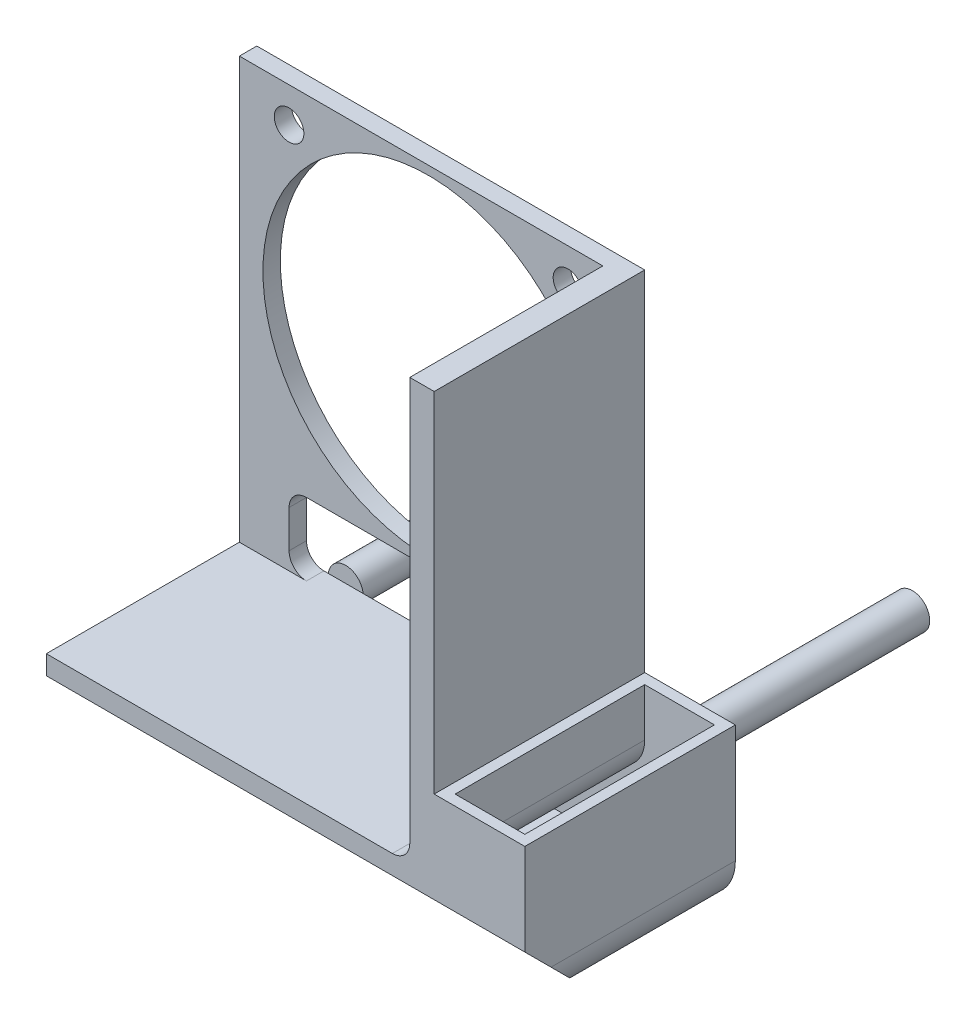
ISO-10303-21;
HEADER;
FILE_DESCRIPTION(('STEP AP214'),'2;1');
FILE_NAME('part.step','',(''),(''),'','','');
FILE_SCHEMA(('AUTOMOTIVE_DESIGN { 1 0 10303 214 1 1 1 1 }'));
ENDSEC;
DATA;
#1=APPLICATION_CONTEXT('core data for automotive mechanical design processes');
#2=APPLICATION_PROTOCOL_DEFINITION('international standard','automotive_design',2000,#1);
#3=PRODUCT_CONTEXT('',#1,'mechanical');
#4=PRODUCT('Part','Part','',(#3));
#5=PRODUCT_RELATED_PRODUCT_CATEGORY('part','',(#4));
#6=PRODUCT_DEFINITION_FORMATION('','',#4);
#7=PRODUCT_DEFINITION_CONTEXT('part definition',#1,'design');
#8=PRODUCT_DEFINITION('design','',#6,#7);
#9=PRODUCT_DEFINITION_SHAPE('','',#8);
#10=(LENGTH_UNIT() NAMED_UNIT(*) SI_UNIT(.MILLI.,.METRE.));
#11=(NAMED_UNIT(*) PLANE_ANGLE_UNIT() SI_UNIT($,.RADIAN.));
#12=(NAMED_UNIT(*) SI_UNIT($,.STERADIAN.) SOLID_ANGLE_UNIT());
#13=UNCERTAINTY_MEASURE_WITH_UNIT(LENGTH_MEASURE(1.E-05),#10,'distance_accuracy_value','');
#14=(GEOMETRIC_REPRESENTATION_CONTEXT(3) GLOBAL_UNCERTAINTY_ASSIGNED_CONTEXT((#13)) GLOBAL_UNIT_ASSIGNED_CONTEXT((#10,
#11,#12)) REPRESENTATION_CONTEXT('',''));
#15=CARTESIAN_POINT('',(0.,0.,0.));
#16=DIRECTION('',(0.,0.,1.));
#17=DIRECTION('',(1.,0.,0.));
#18=AXIS2_PLACEMENT_3D('',#15,#16,#17);
#19=CARTESIAN_POINT('',(2.5,-14.5,-36.));
#20=DIRECTION('',(0.,0.,1.));
#21=DIRECTION('',(1.,0.,0.));
#22=AXIS2_PLACEMENT_3D('',#19,#20,#21);
#23=CYLINDRICAL_SURFACE('',#22,2.);
#24=CARTESIAN_POINT('',(2.5,-14.5,-36.));
#25=DIRECTION('',(0.,0.,-1.));
#26=DIRECTION('',(-1.,0.,0.));
#27=AXIS2_PLACEMENT_3D('',#24,#25,#26);
#28=CIRCLE('',#27,2.);
#29=CARTESIAN_POINT('',(0.499999999999995,-14.5,-36.));
#30=VERTEX_POINT('',#29);
#31=EDGE_CURVE('E11',#30,#30,#28,.T.);
#32=ORIENTED_EDGE('',*,*,#31,.F.);
#33=EDGE_LOOP('',(#32));
#34=FACE_BOUND('',#33,.T.);
#35=CARTESIAN_POINT('',(2.5,-14.5,-6.));
#36=DIRECTION('',(0.,0.,-1.));
#37=DIRECTION('',(-1.,0.,0.));
#38=AXIS2_PLACEMENT_3D('',#35,#36,#37);
#39=CIRCLE('',#38,2.);
#40=CARTESIAN_POINT('',(0.499999999999995,-14.5,-6.));
#41=VERTEX_POINT('',#40);
#42=EDGE_CURVE('E51',#41,#41,#39,.T.);
#43=ORIENTED_EDGE('',*,*,#42,.T.);
#44=EDGE_LOOP('',(#43));
#45=FACE_BOUND('',#44,.T.);
#46=ADVANCED_FACE('F48',(#34,#45),#23,.T.);
#47=CARTESIAN_POINT('',(2.5,-14.5,-36.));
#48=DIRECTION('',(0.,0.,-1.));
#49=DIRECTION('',(-1.,0.,0.));
#50=AXIS2_PLACEMENT_3D('',#47,#48,#49);
#51=PLANE('',#50);
#52=ORIENTED_EDGE('',*,*,#31,.T.);
#53=EDGE_LOOP('',(#52));
#54=FACE_BOUND('',#53,.T.);
#55=ADVANCED_FACE('F63',(#54),#51,.T.);
#56=CARTESIAN_POINT('',(2.5,-14.5,-6.));
#57=DIRECTION('',(0.,0.,-1.));
#58=DIRECTION('',(-1.,0.,0.));
#59=AXIS2_PLACEMENT_3D('',#56,#57,#58);
#60=PLANE('',#59);
#61=ORIENTED_EDGE('',*,*,#42,.F.);
#62=EDGE_LOOP('',(#61));
#63=FACE_BOUND('',#62,.T.);
#64=ADVANCED_FACE('F61',(#63),#60,.F.);
#65=CLOSED_SHELL('',(#46,#55,#64));
#66=MANIFOLD_SOLID_BREP('B2_NOT_SHOWN',#65);
#67=CARTESIAN_POINT('',(37.5,-14.5,-36.));
#68=DIRECTION('',(0.,0.,1.));
#69=DIRECTION('',(1.,0.,0.));
#70=AXIS2_PLACEMENT_3D('',#67,#68,#69);
#71=CYLINDRICAL_SURFACE('',#70,2.);
#72=CARTESIAN_POINT('',(37.5,-14.5,-36.));
#73=DIRECTION('',(0.,0.,-1.));
#74=DIRECTION('',(-1.,0.,0.));
#75=AXIS2_PLACEMENT_3D('',#72,#73,#74);
#76=CIRCLE('',#75,2.);
#77=CARTESIAN_POINT('',(35.5,-14.5,-36.));
#78=VERTEX_POINT('',#77);
#79=EDGE_CURVE('E47',#78,#78,#76,.T.);
#80=ORIENTED_EDGE('',*,*,#79,.F.);
#81=EDGE_LOOP('',(#80));
#82=FACE_BOUND('',#81,.T.);
#83=CARTESIAN_POINT('',(37.5,-14.5,-6.));
#84=DIRECTION('',(0.,0.,-1.));
#85=DIRECTION('',(-1.,0.,0.));
#86=AXIS2_PLACEMENT_3D('',#83,#84,#85);
#87=CIRCLE('',#86,2.);
#88=CARTESIAN_POINT('',(35.5,-14.5,-6.));
#89=VERTEX_POINT('',#88);
#90=EDGE_CURVE('E101',#89,#89,#87,.T.);
#91=ORIENTED_EDGE('',*,*,#90,.T.);
#92=EDGE_LOOP('',(#91));
#93=FACE_BOUND('',#92,.T.);
#94=ADVANCED_FACE('F98',(#82,#93),#71,.T.);
#95=CARTESIAN_POINT('',(37.5,-14.5,-36.));
#96=DIRECTION('',(0.,0.,-1.));
#97=DIRECTION('',(-1.,0.,0.));
#98=AXIS2_PLACEMENT_3D('',#95,#96,#97);
#99=PLANE('',#98);
#100=ORIENTED_EDGE('',*,*,#79,.T.);
#101=EDGE_LOOP('',(#100));
#102=FACE_BOUND('',#101,.T.);
#103=ADVANCED_FACE('F113',(#102),#99,.T.);
#104=CARTESIAN_POINT('',(37.5,-14.5,-6.));
#105=DIRECTION('',(0.,0.,-1.));
#106=DIRECTION('',(-1.,0.,0.));
#107=AXIS2_PLACEMENT_3D('',#104,#105,#106);
#108=PLANE('',#107);
#109=ORIENTED_EDGE('',*,*,#90,.F.);
#110=EDGE_LOOP('',(#109));
#111=FACE_BOUND('',#110,.T.);
#112=ADVANCED_FACE('F111',(#111),#108,.F.);
#113=CLOSED_SHELL('',(#94,#103,#112));
#114=MANIFOLD_SOLID_BREP('B6_NOT_SHOWN',#113);
#115=CARTESIAN_POINT('',(-0.500000000000005,-8.3,1.2));
#116=DIRECTION('',(0.,-1.,0.));
#117=DIRECTION('',(1.,0.,0.));
#118=AXIS2_PLACEMENT_3D('',#115,#116,#117);
#119=PLANE('',#118);
#120=DIRECTION('',(1.,0.,0.));
#121=VECTOR('',#120,1.);
#122=CARTESIAN_POINT('',(0.,-8.3,2.));
#123=LINE('',#122,#121);
#124=CARTESIAN_POINT('',(-1.7,-8.3,2.));
#125=VERTEX_POINT('',#124);
#126=CARTESIAN_POINT('',(6.,-8.3,2.));
#127=VERTEX_POINT('',#126);
#128=EDGE_CURVE('E483',#125,#127,#123,.T.);
#129=ORIENTED_EDGE('',*,*,#128,.F.);
#130=DIRECTION('',(0.,0.,1.));
#131=VECTOR('',#130,1.);
#132=CARTESIAN_POINT('',(-1.7,-8.3,1.2));
#133=LINE('',#132,#131);
#134=CARTESIAN_POINT('',(-1.7,-8.3,24.15));
#135=VERTEX_POINT('',#134);
#136=EDGE_CURVE('E345',#125,#135,#133,.T.);
#137=ORIENTED_EDGE('',*,*,#136,.T.);
#138=DIRECTION('',(1.,0.,0.));
#139=VECTOR('',#138,1.);
#140=CARTESIAN_POINT('',(-0.500000000000005,-8.3,24.15));
#141=LINE('',#140,#139);
#142=CARTESIAN_POINT('',(38.,-8.30000000000001,24.15));
#143=VERTEX_POINT('',#142);
#144=EDGE_CURVE('E462',#135,#143,#141,.T.);
#145=ORIENTED_EDGE('',*,*,#144,.T.);
#146=DIRECTION('',(0.,0.,-1.));
#147=VECTOR('',#146,1.);
#148=CARTESIAN_POINT('',(38.,-8.30000000000001,1.2));
#149=LINE('',#148,#147);
#150=CARTESIAN_POINT('',(38.,-8.30000000000001,0.));
#151=VERTEX_POINT('',#150);
#152=EDGE_CURVE('E544',#143,#151,#149,.T.);
#153=ORIENTED_EDGE('',*,*,#152,.T.);
#154=DIRECTION('',(1.,0.,0.));
#155=VECTOR('',#154,1.);
#156=CARTESIAN_POINT('',(0.,-8.30000000000001,0.));
#157=LINE('',#156,#155);
#158=CARTESIAN_POINT('',(6.,-8.30000000000001,0.));
#159=VERTEX_POINT('',#158);
#160=EDGE_CURVE('E512',#159,#151,#157,.T.);
#161=ORIENTED_EDGE('',*,*,#160,.F.);
#162=DIRECTION('',(0.,0.,1.));
#163=VECTOR('',#162,1.);
#164=CARTESIAN_POINT('',(6.,-8.3,2.));
#165=LINE('',#164,#163);
#166=EDGE_CURVE('E526',#159,#127,#165,.T.);
#167=ORIENTED_EDGE('',*,*,#166,.T.);
#168=EDGE_LOOP('',(#129,#137,#145,#153,#161,#167));
#169=FACE_BOUND('',#168,.T.);
#170=ADVANCED_FACE('F139',(#169),#119,.F.);
#171=CARTESIAN_POINT('',(42.8,-8.30000000000001,72.5310913477569));
#172=DIRECTION('',(1.,0.,0.));
#173=DIRECTION('',(0.,0.,-1.));
#174=AXIS2_PLACEMENT_3D('',#171,#172,#173);
#175=PLANE('',#174);
#176=DIRECTION('',(0.,1.,0.));
#177=VECTOR('',#176,1.);
#178=CARTESIAN_POINT('',(42.8,-8.30000000000001,24.15));
#179=LINE('',#178,#177);
#180=CARTESIAN_POINT('',(42.8,0.,24.15));
#181=VERTEX_POINT('',#180);
#182=CARTESIAN_POINT('',(42.8,40.,24.15));
#183=VERTEX_POINT('',#182);
#184=EDGE_CURVE('E481',#181,#183,#179,.T.);
#185=ORIENTED_EDGE('',*,*,#184,.F.);
#186=DIRECTION('',(0.,0.,1.));
#187=VECTOR('',#186,1.);
#188=CARTESIAN_POINT('',(42.8,0.,1.2));
#189=LINE('',#188,#187);
#190=CARTESIAN_POINT('',(42.8,0.,0.));
#191=VERTEX_POINT('',#190);
#192=EDGE_CURVE('E464',#191,#181,#189,.T.);
#193=ORIENTED_EDGE('',*,*,#192,.F.);
#194=DIRECTION('',(0.,-1.,0.));
#195=VECTOR('',#194,1.);
#196=CARTESIAN_POINT('',(42.8,-8.30000000000001,0.));
#197=LINE('',#196,#195);
#198=CARTESIAN_POINT('',(42.8,40.,0.));
#199=VERTEX_POINT('',#198);
#200=EDGE_CURVE('E448',#199,#191,#197,.T.);
#201=ORIENTED_EDGE('',*,*,#200,.F.);
#202=DIRECTION('',(0.,0.,-1.));
#203=VECTOR('',#202,1.);
#204=CARTESIAN_POINT('',(42.8,40.,72.5310913477569));
#205=LINE('',#204,#203);
#206=EDGE_CURVE('E479',#183,#199,#205,.T.);
#207=ORIENTED_EDGE('',*,*,#206,.F.);
#208=EDGE_LOOP('',(#185,#193,#201,#207));
#209=FACE_BOUND('',#208,.T.);
#210=ADVANCED_FACE('F585',(#209),#175,.T.);
#211=CARTESIAN_POINT('',(0.,40.,2.));
#212=DIRECTION('',(0.,1.,0.));
#213=DIRECTION('',(0.,0.,1.));
#214=AXIS2_PLACEMENT_3D('',#211,#212,#213);
#215=PLANE('',#214);
#216=DIRECTION('',(1.,0.,0.));
#217=VECTOR('',#216,1.);
#218=CARTESIAN_POINT('',(0.,40.,0.));
#219=LINE('',#218,#217);
#220=CARTESIAN_POINT('',(-1.7,40.,0.));
#221=VERTEX_POINT('',#220);
#222=EDGE_CURVE('E336',#221,#199,#219,.T.);
#223=ORIENTED_EDGE('',*,*,#222,.F.);
#224=DIRECTION('',(0.,0.,1.));
#225=VECTOR('',#224,1.);
#226=CARTESIAN_POINT('',(-1.7,40.,-48.3299079245968));
#227=LINE('',#226,#225);
#228=CARTESIAN_POINT('',(-1.7,40.,2.));
#229=VERTEX_POINT('',#228);
#230=EDGE_CURVE('E333',#221,#229,#227,.T.);
#231=ORIENTED_EDGE('',*,*,#230,.T.);
#232=DIRECTION('',(1.,0.,0.));
#233=VECTOR('',#232,1.);
#234=CARTESIAN_POINT('',(0.,40.,2.));
#235=LINE('',#234,#233);
#236=CARTESIAN_POINT('',(40.,40.,2.));
#237=VERTEX_POINT('',#236);
#238=EDGE_CURVE('E317',#229,#237,#235,.T.);
#239=ORIENTED_EDGE('',*,*,#238,.T.);
#240=DIRECTION('',(0.,0.,-1.));
#241=VECTOR('',#240,1.);
#242=CARTESIAN_POINT('',(40.,40.,72.5310913477569));
#243=LINE('',#242,#241);
#244=CARTESIAN_POINT('',(40.,40.,24.15));
#245=VERTEX_POINT('',#244);
#246=EDGE_CURVE('E486',#245,#237,#243,.T.);
#247=ORIENTED_EDGE('',*,*,#246,.F.);
#248=DIRECTION('',(-1.,0.,0.));
#249=VECTOR('',#248,1.);
#250=CARTESIAN_POINT('',(42.8,40.,24.15));
#251=LINE('',#250,#249);
#252=EDGE_CURVE('E478',#183,#245,#251,.T.);
#253=ORIENTED_EDGE('',*,*,#252,.F.);
#254=ORIENTED_EDGE('',*,*,#206,.T.);
#255=EDGE_LOOP('',(#223,#231,#239,#247,#253,#254));
#256=FACE_BOUND('',#255,.T.);
#257=ADVANCED_FACE('F334',(#256),#215,.T.);
#258=CARTESIAN_POINT('',(0.,0.,2.));
#259=DIRECTION('',(0.,0.,1.));
#260=DIRECTION('',(1.,0.,0.));
#261=AXIS2_PLACEMENT_3D('',#258,#259,#260);
#262=PLANE('',#261);
#263=CARTESIAN_POINT('',(20.,20.,2.));
#264=DIRECTION('',(0.,0.,1.));
#265=DIRECTION('',(1.,0.,0.));
#266=AXIS2_PLACEMENT_3D('',#263,#264,#265);
#267=CIRCLE('',#266,19.);
#268=CARTESIAN_POINT('',(39.,20.,2.));
#269=VERTEX_POINT('',#268);
#270=EDGE_CURVE('E340',#269,#269,#267,.T.);
#271=ORIENTED_EDGE('',*,*,#270,.F.);
#272=EDGE_LOOP('',(#271));
#273=FACE_BOUND('',#272,.T.);
#274=DIRECTION('',(0.,-1.,0.));
#275=VECTOR('',#274,1.);
#276=CARTESIAN_POINT('',(4.,-8.30000000000001,2.));
#277=LINE('',#276,#275);
#278=CARTESIAN_POINT('',(4.,-2.,2.));
#279=VERTEX_POINT('',#278);
#280=CARTESIAN_POINT('',(4.,-6.3,2.));
#281=VERTEX_POINT('',#280);
#282=EDGE_CURVE('E354',#279,#281,#277,.T.);
#283=ORIENTED_EDGE('',*,*,#282,.F.);
#284=CARTESIAN_POINT('',(6.,-2.,2.));
#285=DIRECTION('',(0.,0.,1.));
#286=DIRECTION('',(1.,0.,0.));
#287=AXIS2_PLACEMENT_3D('',#284,#285,#286);
#288=CIRCLE('',#287,2.);
#289=CARTESIAN_POINT('',(6.,0.,2.));
#290=VERTEX_POINT('',#289);
#291=EDGE_CURVE('E532',#279,#290,#288,.F.);
#292=ORIENTED_EDGE('',*,*,#291,.T.);
#293=DIRECTION('',(-1.,0.,0.));
#294=VECTOR('',#293,1.);
#295=CARTESIAN_POINT('',(40.,0.,2.));
#296=LINE('',#295,#294);
#297=CARTESIAN_POINT('',(38.,0.,2.));
#298=VERTEX_POINT('',#297);
#299=EDGE_CURVE('E351',#298,#290,#296,.T.);
#300=ORIENTED_EDGE('',*,*,#299,.F.);
#301=CARTESIAN_POINT('',(38.,-2.,2.));
#302=DIRECTION('',(0.,0.,1.));
#303=DIRECTION('',(1.,0.,0.));
#304=AXIS2_PLACEMENT_3D('',#301,#302,#303);
#305=CIRCLE('',#304,2.);
#306=CARTESIAN_POINT('',(40.,-2.,2.));
#307=VERTEX_POINT('',#306);
#308=EDGE_CURVE('E540',#298,#307,#305,.F.);
#309=ORIENTED_EDGE('',*,*,#308,.T.);
#310=DIRECTION('',(0.,1.,0.));
#311=VECTOR('',#310,1.);
#312=CARTESIAN_POINT('',(40.,0.,2.));
#313=LINE('',#312,#311);
#314=EDGE_CURVE('E326',#307,#237,#313,.T.);
#315=ORIENTED_EDGE('',*,*,#314,.T.);
#316=ORIENTED_EDGE('',*,*,#238,.F.);
#317=DIRECTION('',(0.,-1.,0.));
#318=VECTOR('',#317,1.);
#319=CARTESIAN_POINT('',(-1.7,40.,2.));
#320=LINE('',#319,#318);
#321=EDGE_CURVE('E323',#229,#125,#320,.T.);
#322=ORIENTED_EDGE('',*,*,#321,.T.);
#323=ORIENTED_EDGE('',*,*,#128,.T.);
#324=CARTESIAN_POINT('',(6.,-6.3,2.));
#325=DIRECTION('',(0.,0.,1.));
#326=DIRECTION('',(1.,0.,0.));
#327=AXIS2_PLACEMENT_3D('',#324,#325,#326);
#328=CIRCLE('',#327,2.);
#329=EDGE_CURVE('E536',#127,#281,#328,.F.);
#330=ORIENTED_EDGE('',*,*,#329,.T.);
#331=EDGE_LOOP('',(#283,#292,#300,#309,#315,#316,#322,#323,#330));
#332=FACE_BOUND('',#331,.T.);
#333=CARTESIAN_POINT('',(4.00000000000001,36.,2.));
#334=DIRECTION('',(0.,0.,1.));
#335=DIRECTION('',(1.,0.,0.));
#336=AXIS2_PLACEMENT_3D('',#333,#334,#335);
#337=CIRCLE('',#336,1.7);
#338=CARTESIAN_POINT('',(5.70000000000001,36.,2.));
#339=VERTEX_POINT('',#338);
#340=EDGE_CURVE('E490',#339,#339,#337,.T.);
#341=ORIENTED_EDGE('',*,*,#340,.F.);
#342=EDGE_LOOP('',(#341));
#343=FACE_BOUND('',#342,.T.);
#344=CARTESIAN_POINT('',(36.,4.,2.));
#345=DIRECTION('',(0.,0.,1.));
#346=DIRECTION('',(1.,0.,0.));
#347=AXIS2_PLACEMENT_3D('',#344,#345,#346);
#348=CIRCLE('',#347,1.7);
#349=CARTESIAN_POINT('',(37.7,4.,2.));
#350=VERTEX_POINT('',#349);
#351=EDGE_CURVE('E496',#350,#350,#348,.T.);
#352=ORIENTED_EDGE('',*,*,#351,.F.);
#353=EDGE_LOOP('',(#352));
#354=FACE_BOUND('',#353,.T.);
#355=CARTESIAN_POINT('',(36.,36.,2.));
#356=DIRECTION('',(0.,0.,1.));
#357=DIRECTION('',(1.,0.,0.));
#358=AXIS2_PLACEMENT_3D('',#355,#356,#357);
#359=CIRCLE('',#358,1.7);
#360=CARTESIAN_POINT('',(37.7,36.,2.));
#361=VERTEX_POINT('',#360);
#362=EDGE_CURVE('E502',#361,#361,#359,.T.);
#363=ORIENTED_EDGE('',*,*,#362,.F.);
#364=EDGE_LOOP('',(#363));
#365=FACE_BOUND('',#364,.T.);
#366=ADVANCED_FACE('F320',(#273,#332,#343,#354,#365),#262,.T.);
#367=CARTESIAN_POINT('',(0.,0.,0.));
#368=DIRECTION('',(0.,0.,1.));
#369=DIRECTION('',(1.,0.,0.));
#370=AXIS2_PLACEMENT_3D('',#367,#368,#369);
#371=PLANE('',#370);
#372=DIRECTION('',(0.,1.,0.));
#373=VECTOR('',#372,1.);
#374=CARTESIAN_POINT('',(-1.70000000000001,-17.5,0.));
#375=LINE('',#374,#373);
#376=CARTESIAN_POINT('',(-1.70000000000001,-18.7,0.));
#377=VERTEX_POINT('',#376);
#378=EDGE_CURVE('E450',#377,#221,#375,.T.);
#379=ORIENTED_EDGE('',*,*,#378,.T.);
#380=ORIENTED_EDGE('',*,*,#222,.T.);
#381=ORIENTED_EDGE('',*,*,#200,.T.);
#382=DIRECTION('',(1.,0.,0.));
#383=VECTOR('',#382,1.);
#384=CARTESIAN_POINT('',(44.,0.,0.));
#385=LINE('',#384,#383);
#386=CARTESIAN_POINT('',(53.2,0.,0.));
#387=VERTEX_POINT('',#386);
#388=EDGE_CURVE('E452',#191,#387,#385,.T.);
#389=ORIENTED_EDGE('',*,*,#388,.T.);
#390=DIRECTION('',(0.,-1.,0.));
#391=VECTOR('',#390,1.);
#392=CARTESIAN_POINT('',(53.2,0.,0.));
#393=LINE('',#392,#391);
#394=CARTESIAN_POINT('',(53.2,-13.5,0.));
#395=VERTEX_POINT('',#394);
#396=EDGE_CURVE('E439',#387,#395,#393,.T.);
#397=ORIENTED_EDGE('',*,*,#396,.T.);
#398=CARTESIAN_POINT('',(48.,-13.5,0.));
#399=DIRECTION('',(0.,0.,-1.));
#400=DIRECTION('',(-1.,0.,0.));
#401=AXIS2_PLACEMENT_3D('',#398,#399,#400);
#402=CIRCLE('',#401,5.2);
#403=CARTESIAN_POINT('',(48.,-18.7,0.));
#404=VERTEX_POINT('',#403);
#405=EDGE_CURVE('E437',#395,#404,#402,.T.);
#406=ORIENTED_EDGE('',*,*,#405,.T.);
#407=DIRECTION('',(-1.,0.,0.));
#408=VECTOR('',#407,1.);
#409=CARTESIAN_POINT('',(52.,-18.7,0.));
#410=LINE('',#409,#408);
#411=EDGE_CURVE('E442',#404,#377,#410,.T.);
#412=ORIENTED_EDGE('',*,*,#411,.T.);
#413=EDGE_LOOP('',(#379,#380,#381,#389,#397,#406,#412));
#414=FACE_BOUND('',#413,.T.);
#415=CARTESIAN_POINT('',(20.,20.,0.));
#416=DIRECTION('',(0.,0.,1.));
#417=DIRECTION('',(1.,0.,0.));
#418=AXIS2_PLACEMENT_3D('',#415,#416,#417);
#419=CIRCLE('',#418,19.);
#420=CARTESIAN_POINT('',(39.,20.,0.));
#421=VERTEX_POINT('',#420);
#422=EDGE_CURVE('E350',#421,#421,#419,.T.);
#423=ORIENTED_EDGE('',*,*,#422,.T.);
#424=EDGE_LOOP('',(#423));
#425=FACE_BOUND('',#424,.T.);
#426=DIRECTION('',(0.,-1.,0.));
#427=VECTOR('',#426,1.);
#428=CARTESIAN_POINT('',(4.,0.,0.));
#429=LINE('',#428,#427);
#430=CARTESIAN_POINT('',(4.,-2.,0.));
#431=VERTEX_POINT('',#430);
#432=CARTESIAN_POINT('',(4.,-6.3,0.));
#433=VERTEX_POINT('',#432);
#434=EDGE_CURVE('E357',#431,#433,#429,.T.);
#435=ORIENTED_EDGE('',*,*,#434,.T.);
#436=CARTESIAN_POINT('',(6.,-6.3,0.));
#437=DIRECTION('',(0.,0.,1.));
#438=DIRECTION('',(1.,0.,0.));
#439=AXIS2_PLACEMENT_3D('',#436,#437,#438);
#440=CIRCLE('',#439,2.);
#441=EDGE_CURVE('E538',#433,#159,#440,.T.);
#442=ORIENTED_EDGE('',*,*,#441,.T.);
#443=ORIENTED_EDGE('',*,*,#160,.T.);
#444=CARTESIAN_POINT('',(38.,-6.30000000000001,0.));
#445=DIRECTION('',(0.,0.,1.));
#446=DIRECTION('',(1.,0.,0.));
#447=AXIS2_PLACEMENT_3D('',#444,#445,#446);
#448=CIRCLE('',#447,2.);
#449=CARTESIAN_POINT('',(40.,-6.30000000000001,0.));
#450=VERTEX_POINT('',#449);
#451=EDGE_CURVE('E147',#151,#450,#448,.T.);
#452=ORIENTED_EDGE('',*,*,#451,.T.);
#453=DIRECTION('',(0.,1.,0.));
#454=VECTOR('',#453,1.);
#455=CARTESIAN_POINT('',(40.,0.,0.));
#456=LINE('',#455,#454);
#457=CARTESIAN_POINT('',(40.,-2.,0.));
#458=VERTEX_POINT('',#457);
#459=EDGE_CURVE('E360',#450,#458,#456,.T.);
#460=ORIENTED_EDGE('',*,*,#459,.T.);
#461=CARTESIAN_POINT('',(38.,-2.,0.));
#462=DIRECTION('',(0.,0.,1.));
#463=DIRECTION('',(1.,0.,0.));
#464=AXIS2_PLACEMENT_3D('',#461,#462,#463);
#465=CIRCLE('',#464,2.);
#466=CARTESIAN_POINT('',(38.,0.,0.));
#467=VERTEX_POINT('',#466);
#468=EDGE_CURVE('E542',#458,#467,#465,.T.);
#469=ORIENTED_EDGE('',*,*,#468,.T.);
#470=DIRECTION('',(-1.,0.,0.));
#471=VECTOR('',#470,1.);
#472=CARTESIAN_POINT('',(0.,0.,0.));
#473=LINE('',#472,#471);
#474=CARTESIAN_POINT('',(6.,0.,0.));
#475=VERTEX_POINT('',#474);
#476=EDGE_CURVE('E330',#467,#475,#473,.T.);
#477=ORIENTED_EDGE('',*,*,#476,.T.);
#478=CARTESIAN_POINT('',(6.,-2.,0.));
#479=DIRECTION('',(0.,0.,1.));
#480=DIRECTION('',(1.,0.,0.));
#481=AXIS2_PLACEMENT_3D('',#478,#479,#480);
#482=CIRCLE('',#481,2.);
#483=EDGE_CURVE('E534',#475,#431,#482,.T.);
#484=ORIENTED_EDGE('',*,*,#483,.T.);
#485=EDGE_LOOP('',(#435,#442,#443,#452,#460,#469,#477,#484));
#486=FACE_BOUND('',#485,.T.);
#487=CARTESIAN_POINT('',(36.,36.,0.));
#488=DIRECTION('',(0.,0.,1.));
#489=DIRECTION('',(1.,0.,0.));
#490=AXIS2_PLACEMENT_3D('',#487,#488,#489);
#491=CIRCLE('',#490,1.7);
#492=CARTESIAN_POINT('',(37.7,36.,0.));
#493=VERTEX_POINT('',#492);
#494=EDGE_CURVE('E505',#493,#493,#491,.T.);
#495=ORIENTED_EDGE('',*,*,#494,.T.);
#496=EDGE_LOOP('',(#495));
#497=FACE_BOUND('',#496,.T.);
#498=CARTESIAN_POINT('',(36.,4.,0.));
#499=DIRECTION('',(0.,0.,1.));
#500=DIRECTION('',(1.,0.,0.));
#501=AXIS2_PLACEMENT_3D('',#498,#499,#500);
#502=CIRCLE('',#501,1.7);
#503=CARTESIAN_POINT('',(37.7,4.,0.));
#504=VERTEX_POINT('',#503);
#505=EDGE_CURVE('E499',#504,#504,#502,.T.);
#506=ORIENTED_EDGE('',*,*,#505,.T.);
#507=EDGE_LOOP('',(#506));
#508=FACE_BOUND('',#507,.T.);
#509=CARTESIAN_POINT('',(4.00000000000001,36.,0.));
#510=DIRECTION('',(0.,0.,1.));
#511=DIRECTION('',(1.,0.,0.));
#512=AXIS2_PLACEMENT_3D('',#509,#510,#511);
#513=CIRCLE('',#512,1.7);
#514=CARTESIAN_POINT('',(5.70000000000001,36.,0.));
#515=VERTEX_POINT('',#514);
#516=EDGE_CURVE('E493',#515,#515,#513,.T.);
#517=ORIENTED_EDGE('',*,*,#516,.T.);
#518=EDGE_LOOP('',(#517));
#519=FACE_BOUND('',#518,.T.);
#520=ADVANCED_FACE('F554',(#414,#425,#486,#497,#508,#519),#371,.F.);
#521=CARTESIAN_POINT('',(36.,36.,2.));
#522=DIRECTION('',(0.,0.,1.));
#523=DIRECTION('',(1.,0.,0.));
#524=AXIS2_PLACEMENT_3D('',#521,#522,#523);
#525=CYLINDRICAL_SURFACE('',#524,1.7);
#526=ORIENTED_EDGE('',*,*,#494,.F.);
#527=EDGE_LOOP('',(#526));
#528=FACE_BOUND('',#527,.T.);
#529=ORIENTED_EDGE('',*,*,#362,.T.);
#530=EDGE_LOOP('',(#529));
#531=FACE_BOUND('',#530,.T.);
#532=ADVANCED_FACE('F690',(#528,#531),#525,.F.);
#533=CARTESIAN_POINT('',(36.,4.,2.));
#534=DIRECTION('',(0.,0.,1.));
#535=DIRECTION('',(1.,0.,0.));
#536=AXIS2_PLACEMENT_3D('',#533,#534,#535);
#537=CYLINDRICAL_SURFACE('',#536,1.7);
#538=ORIENTED_EDGE('',*,*,#505,.F.);
#539=EDGE_LOOP('',(#538));
#540=FACE_BOUND('',#539,.T.);
#541=ORIENTED_EDGE('',*,*,#351,.T.);
#542=EDGE_LOOP('',(#541));
#543=FACE_BOUND('',#542,.T.);
#544=ADVANCED_FACE('F686',(#540,#543),#537,.F.);
#545=CARTESIAN_POINT('',(4.00000000000001,36.,2.));
#546=DIRECTION('',(0.,0.,1.));
#547=DIRECTION('',(1.,0.,0.));
#548=AXIS2_PLACEMENT_3D('',#545,#546,#547);
#549=CYLINDRICAL_SURFACE('',#548,1.7);
#550=ORIENTED_EDGE('',*,*,#516,.F.);
#551=EDGE_LOOP('',(#550));
#552=FACE_BOUND('',#551,.T.);
#553=ORIENTED_EDGE('',*,*,#340,.T.);
#554=EDGE_LOOP('',(#553));
#555=FACE_BOUND('',#554,.T.);
#556=ADVANCED_FACE('F682',(#552,#555),#549,.F.);
#557=CARTESIAN_POINT('',(40.,-8.30000000000001,72.5310913477569));
#558=DIRECTION('',(-1.,0.,0.));
#559=DIRECTION('',(0.,0.,1.));
#560=AXIS2_PLACEMENT_3D('',#557,#558,#559);
#561=PLANE('',#560);
#562=ORIENTED_EDGE('',*,*,#459,.F.);
#563=DIRECTION('',(0.,0.,-1.));
#564=VECTOR('',#563,1.);
#565=CARTESIAN_POINT('',(40.,-6.30000000000001,72.5310913477569));
#566=LINE('',#565,#564);
#567=CARTESIAN_POINT('',(40.,-6.30000000000001,24.15));
#568=VERTEX_POINT('',#567);
#569=EDGE_CURVE('E154',#450,#568,#566,.F.);
#570=ORIENTED_EDGE('',*,*,#569,.T.);
#571=DIRECTION('',(0.,-1.,0.));
#572=VECTOR('',#571,1.);
#573=CARTESIAN_POINT('',(40.,-8.30000000000001,24.15));
#574=LINE('',#573,#572);
#575=EDGE_CURVE('E476',#245,#568,#574,.T.);
#576=ORIENTED_EDGE('',*,*,#575,.F.);
#577=ORIENTED_EDGE('',*,*,#246,.T.);
#578=ORIENTED_EDGE('',*,*,#314,.F.);
#579=DIRECTION('',(0.,0.,1.));
#580=VECTOR('',#579,1.);
#581=CARTESIAN_POINT('',(40.,-2.,72.5310913477569));
#582=LINE('',#581,#580);
#583=EDGE_CURVE('E529',#307,#458,#582,.F.);
#584=ORIENTED_EDGE('',*,*,#583,.T.);
#585=EDGE_LOOP('',(#562,#570,#576,#577,#578,#584));
#586=FACE_BOUND('',#585,.T.);
#587=ADVANCED_FACE('F578',(#586),#561,.T.);
#588=CARTESIAN_POINT('',(0.,0.,24.15));
#589=DIRECTION('',(0.,0.,-1.));
#590=DIRECTION('',(-1.,0.,0.));
#591=AXIS2_PLACEMENT_3D('',#588,#589,#590);
#592=PLANE('',#591);
#593=ORIENTED_EDGE('',*,*,#575,.T.);
#594=CARTESIAN_POINT('',(38.,-6.30000000000001,24.15));
#595=DIRECTION('',(0.,0.,-1.));
#596=DIRECTION('',(-1.,0.,0.));
#597=AXIS2_PLACEMENT_3D('',#594,#595,#596);
#598=CIRCLE('',#597,2.);
#599=EDGE_CURVE('E96',#568,#143,#598,.T.);
#600=ORIENTED_EDGE('',*,*,#599,.T.);
#601=ORIENTED_EDGE('',*,*,#144,.F.);
#602=DIRECTION('',(0.,1.,0.));
#603=VECTOR('',#602,1.);
#604=CARTESIAN_POINT('',(-1.70000000000001,-17.5,24.15));
#605=LINE('',#604,#603);
#606=CARTESIAN_POINT('',(-1.70000000000001,-10.4970562748477,24.15));
#607=VERTEX_POINT('',#606);
#608=EDGE_CURVE('E446',#607,#135,#605,.T.);
#609=ORIENTED_EDGE('',*,*,#608,.F.);
#610=DIRECTION('',(-1.,0.,0.));
#611=VECTOR('',#610,1.);
#612=CARTESIAN_POINT('',(52.,-10.4970562748477,24.15));
#613=LINE('',#612,#611);
#614=CARTESIAN_POINT('',(53.2,-10.4970562748477,24.15));
#615=VERTEX_POINT('',#614);
#616=EDGE_CURVE('E434',#607,#615,#613,.F.);
#617=ORIENTED_EDGE('',*,*,#616,.T.);
#618=DIRECTION('',(0.,-1.,0.));
#619=VECTOR('',#618,1.);
#620=CARTESIAN_POINT('',(53.2,0.,24.15));
#621=LINE('',#620,#619);
#622=CARTESIAN_POINT('',(53.2,0.,24.15));
#623=VERTEX_POINT('',#622);
#624=EDGE_CURVE('E429',#623,#615,#621,.T.);
#625=ORIENTED_EDGE('',*,*,#624,.F.);
#626=DIRECTION('',(1.,0.,0.));
#627=VECTOR('',#626,1.);
#628=CARTESIAN_POINT('',(44.,0.,24.15));
#629=LINE('',#628,#627);
#630=EDGE_CURVE('E443',#181,#623,#629,.T.);
#631=ORIENTED_EDGE('',*,*,#630,.F.);
#632=ORIENTED_EDGE('',*,*,#184,.T.);
#633=ORIENTED_EDGE('',*,*,#252,.T.);
#634=EDGE_LOOP('',(#593,#600,#601,#609,#617,#625,#631,#632,#633));
#635=FACE_BOUND('',#634,.T.);
#636=ADVANCED_FACE('F603',(#635),#592,.F.);
#637=CARTESIAN_POINT('',(44.,0.,1.2));
#638=DIRECTION('',(0.,-1.,0.));
#639=DIRECTION('',(0.,0.,-1.));
#640=AXIS2_PLACEMENT_3D('',#637,#638,#639);
#641=PLANE('',#640);
#642=ORIENTED_EDGE('',*,*,#630,.T.);
#643=DIRECTION('',(0.,0.,1.));
#644=VECTOR('',#643,1.);
#645=CARTESIAN_POINT('',(53.2,0.,1.2));
#646=LINE('',#645,#644);
#647=EDGE_CURVE('E469',#387,#623,#646,.T.);
#648=ORIENTED_EDGE('',*,*,#647,.F.);
#649=ORIENTED_EDGE('',*,*,#388,.F.);
#650=ORIENTED_EDGE('',*,*,#192,.T.);
#651=EDGE_LOOP('',(#642,#648,#649,#650));
#652=FACE_BOUND('',#651,.T.);
#653=DIRECTION('',(1.,0.,0.));
#654=VECTOR('',#653,1.);
#655=CARTESIAN_POINT('',(44.,0.,22.95));
#656=LINE('',#655,#654);
#657=CARTESIAN_POINT('',(44.,0.,22.95));
#658=VERTEX_POINT('',#657);
#659=CARTESIAN_POINT('',(52.,0.,22.95));
#660=VERTEX_POINT('',#659);
#661=EDGE_CURVE('E367',#658,#660,#656,.T.);
#662=ORIENTED_EDGE('',*,*,#661,.F.);
#663=DIRECTION('',(0.,0.,1.));
#664=VECTOR('',#663,1.);
#665=CARTESIAN_POINT('',(44.,0.,1.2));
#666=LINE('',#665,#664);
#667=CARTESIAN_POINT('',(44.,0.,1.2));
#668=VERTEX_POINT('',#667);
#669=EDGE_CURVE('E393',#668,#658,#666,.T.);
#670=ORIENTED_EDGE('',*,*,#669,.F.);
#671=DIRECTION('',(1.,0.,0.));
#672=VECTOR('',#671,1.);
#673=CARTESIAN_POINT('',(44.,0.,1.2));
#674=LINE('',#673,#672);
#675=CARTESIAN_POINT('',(52.,0.,1.2));
#676=VERTEX_POINT('',#675);
#677=EDGE_CURVE('E377',#668,#676,#674,.T.);
#678=ORIENTED_EDGE('',*,*,#677,.T.);
#679=DIRECTION('',(0.,0.,1.));
#680=VECTOR('',#679,1.);
#681=CARTESIAN_POINT('',(52.,0.,1.2));
#682=LINE('',#681,#680);
#683=EDGE_CURVE('E380',#676,#660,#682,.T.);
#684=ORIENTED_EDGE('',*,*,#683,.T.);
#685=EDGE_LOOP('',(#662,#670,#678,#684));
#686=FACE_BOUND('',#685,.T.);
#687=ADVANCED_FACE('F609',(#652,#686),#641,.F.);
#688=CARTESIAN_POINT('',(53.2,0.,1.2));
#689=DIRECTION('',(-1.,0.,0.));
#690=DIRECTION('',(0.,0.,1.));
#691=AXIS2_PLACEMENT_3D('',#688,#689,#690);
#692=PLANE('',#691);
#693=DIRECTION('',(0.,0.707106781186549,0.707106781186546));
#694=VECTOR('',#693,1.);
#695=CARTESIAN_POINT('',(53.2,-18.3485281374239,16.2985281374239));
#696=LINE('',#695,#694);
#697=CARTESIAN_POINT('',(53.2,-13.5,21.1470562748477));
#698=VERTEX_POINT('',#697);
#699=EDGE_CURVE('E430',#615,#698,#696,.F.);
#700=ORIENTED_EDGE('',*,*,#699,.T.);
#701=DIRECTION('',(0.,0.,1.));
#702=VECTOR('',#701,1.);
#703=CARTESIAN_POINT('',(53.2,-13.5,1.2));
#704=LINE('',#703,#702);
#705=EDGE_CURVE('E435',#698,#395,#704,.F.);
#706=ORIENTED_EDGE('',*,*,#705,.T.);
#707=ORIENTED_EDGE('',*,*,#396,.F.);
#708=ORIENTED_EDGE('',*,*,#647,.T.);
#709=ORIENTED_EDGE('',*,*,#624,.T.);
#710=EDGE_LOOP('',(#700,#706,#707,#708,#709));
#711=FACE_BOUND('',#710,.T.);
#712=ADVANCED_FACE('F605',(#711),#692,.F.);
#713=CARTESIAN_POINT('',(52.,-18.7,1.2));
#714=DIRECTION('',(0.,1.,0.));
#715=DIRECTION('',(0.,0.,1.));
#716=AXIS2_PLACEMENT_3D('',#713,#714,#715);
#717=PLANE('',#716);
#718=ORIENTED_EDGE('',*,*,#411,.F.);
#719=DIRECTION('',(0.,0.,1.));
#720=VECTOR('',#719,1.);
#721=CARTESIAN_POINT('',(48.,-18.7,1.2));
#722=LINE('',#721,#720);
#723=CARTESIAN_POINT('',(48.,-18.7,15.9470562748477));
#724=VERTEX_POINT('',#723);
#725=EDGE_CURVE('E433',#404,#724,#722,.T.);
#726=ORIENTED_EDGE('',*,*,#725,.T.);
#727=DIRECTION('',(1.,0.,0.));
#728=VECTOR('',#727,1.);
#729=CARTESIAN_POINT('',(52.,-18.7,15.9470562748477));
#730=LINE('',#729,#728);
#731=CARTESIAN_POINT('',(-1.70000000000001,-18.7,15.9470562748477));
#732=VERTEX_POINT('',#731);
#733=EDGE_CURVE('E455',#724,#732,#730,.F.);
#734=ORIENTED_EDGE('',*,*,#733,.T.);
#735=DIRECTION('',(0.,0.,1.));
#736=VECTOR('',#735,1.);
#737=CARTESIAN_POINT('',(-1.70000000000001,-18.7,1.2));
#738=LINE('',#737,#736);
#739=EDGE_CURVE('E458',#377,#732,#738,.T.);
#740=ORIENTED_EDGE('',*,*,#739,.F.);
#741=EDGE_LOOP('',(#718,#726,#734,#740));
#742=FACE_BOUND('',#741,.T.);
#743=ADVANCED_FACE('F595',(#742),#717,.F.);
#744=CARTESIAN_POINT('',(-1.70000000000001,-17.5,1.2));
#745=DIRECTION('',(1.,0.,0.));
#746=DIRECTION('',(0.,1.,0.));
#747=AXIS2_PLACEMENT_3D('',#744,#745,#746);
#748=PLANE('',#747);
#749=ORIENTED_EDGE('',*,*,#739,.T.);
#750=DIRECTION('',(0.,-0.707106781186549,-0.707106781186546));
#751=VECTOR('',#750,1.);
#752=CARTESIAN_POINT('',(-1.70000000000001,-18.3485281374238,16.2985281374239));
#753=LINE('',#752,#751);
#754=EDGE_CURVE('E457',#732,#607,#753,.F.);
#755=ORIENTED_EDGE('',*,*,#754,.T.);
#756=ORIENTED_EDGE('',*,*,#608,.T.);
#757=ORIENTED_EDGE('',*,*,#136,.F.);
#758=ORIENTED_EDGE('',*,*,#321,.F.);
#759=ORIENTED_EDGE('',*,*,#230,.F.);
#760=ORIENTED_EDGE('',*,*,#378,.F.);
#761=EDGE_LOOP('',(#749,#755,#756,#757,#758,#759,#760));
#762=FACE_BOUND('',#761,.T.);
#763=ADVANCED_FACE('F343',(#762),#748,.F.);
#764=CARTESIAN_POINT('',(52.,-18.3485281374239,16.2985281374239));
#765=DIRECTION('',(0.,0.707106781186546,-0.707106781186549));
#766=DIRECTION('',(-1.,0.,0.));
#767=AXIS2_PLACEMENT_3D('',#764,#765,#766);
#768=PLANE('',#767);
#769=ORIENTED_EDGE('',*,*,#733,.F.);
#770=CARTESIAN_POINT('',(48.,-13.5,21.1470562748477));
#771=DIRECTION('',(0.,0.707106781186546,-0.707106781186549));
#772=DIRECTION('',(0.,0.707106781186549,0.707106781186546));
#773=AXIS2_PLACEMENT_3D('',#770,#771,#772);
#774=ELLIPSE('',#773,7.35391052434008,5.2);
#775=EDGE_CURVE('E438',#724,#698,#774,.F.);
#776=ORIENTED_EDGE('',*,*,#775,.T.);
#777=ORIENTED_EDGE('',*,*,#699,.F.);
#778=ORIENTED_EDGE('',*,*,#616,.F.);
#779=ORIENTED_EDGE('',*,*,#754,.F.);
#780=EDGE_LOOP('',(#769,#776,#777,#778,#779));
#781=FACE_BOUND('',#780,.T.);
#782=ADVANCED_FACE('F600',(#781),#768,.F.);
#783=CARTESIAN_POINT('',(48.,-13.5,1.2));
#784=DIRECTION('',(0.,0.,1.));
#785=DIRECTION('',(1.,0.,0.));
#786=AXIS2_PLACEMENT_3D('',#783,#784,#785);
#787=CYLINDRICAL_SURFACE('',#786,5.2);
#788=ORIENTED_EDGE('',*,*,#405,.F.);
#789=ORIENTED_EDGE('',*,*,#705,.F.);
#790=ORIENTED_EDGE('',*,*,#775,.F.);
#791=ORIENTED_EDGE('',*,*,#725,.F.);
#792=EDGE_LOOP('',(#788,#789,#790,#791));
#793=FACE_BOUND('',#792,.T.);
#794=ADVANCED_FACE('F663',(#793),#787,.T.);
#795=CARTESIAN_POINT('',(52.,0.,1.2));
#796=DIRECTION('',(-1.,0.,0.));
#797=DIRECTION('',(0.,0.,1.));
#798=AXIS2_PLACEMENT_3D('',#795,#796,#797);
#799=PLANE('',#798);
#800=DIRECTION('',(0.,0.707106781186549,0.707106781186546));
#801=VECTOR('',#800,1.);
#802=CARTESIAN_POINT('',(52.,-17.5,15.45));
#803=LINE('',#802,#801);
#804=CARTESIAN_POINT('',(52.,-9.99999999999998,22.95));
#805=VERTEX_POINT('',#804);
#806=CARTESIAN_POINT('',(52.,-13.5,19.45));
#807=VERTEX_POINT('',#806);
#808=EDGE_CURVE('E408',#805,#807,#803,.F.);
#809=ORIENTED_EDGE('',*,*,#808,.F.);
#810=DIRECTION('',(0.,-1.,0.));
#811=VECTOR('',#810,1.);
#812=CARTESIAN_POINT('',(52.,0.,22.95));
#813=LINE('',#812,#811);
#814=EDGE_CURVE('E362',#660,#805,#813,.T.);
#815=ORIENTED_EDGE('',*,*,#814,.F.);
#816=ORIENTED_EDGE('',*,*,#683,.F.);
#817=DIRECTION('',(0.,-1.,0.));
#818=VECTOR('',#817,1.);
#819=CARTESIAN_POINT('',(52.,0.,1.2));
#820=LINE('',#819,#818);
#821=CARTESIAN_POINT('',(52.,-13.5,1.2));
#822=VERTEX_POINT('',#821);
#823=EDGE_CURVE('E363',#676,#822,#820,.T.);
#824=ORIENTED_EDGE('',*,*,#823,.T.);
#825=DIRECTION('',(0.,0.,1.));
#826=VECTOR('',#825,1.);
#827=CARTESIAN_POINT('',(52.,-13.5,1.2));
#828=LINE('',#827,#826);
#829=EDGE_CURVE('E416',#807,#822,#828,.F.);
#830=ORIENTED_EDGE('',*,*,#829,.F.);
#831=EDGE_LOOP('',(#809,#815,#816,#824,#830));
#832=FACE_BOUND('',#831,.T.);
#833=ADVANCED_FACE('F622',(#832),#799,.T.);
#834=CARTESIAN_POINT('',(52.,-17.5,1.2));
#835=DIRECTION('',(0.,1.,0.));
#836=DIRECTION('',(0.,0.,1.));
#837=AXIS2_PLACEMENT_3D('',#834,#835,#836);
#838=PLANE('',#837);
#839=DIRECTION('',(-1.,0.,0.));
#840=VECTOR('',#839,1.);
#841=CARTESIAN_POINT('',(52.,-17.5,1.2));
#842=LINE('',#841,#840);
#843=CARTESIAN_POINT('',(48.,-17.5,1.2));
#844=VERTEX_POINT('',#843);
#845=CARTESIAN_POINT('',(-0.500000000000007,-17.5,1.2));
#846=VERTEX_POINT('',#845);
#847=EDGE_CURVE('E366',#844,#846,#842,.T.);
#848=ORIENTED_EDGE('',*,*,#847,.T.);
#849=DIRECTION('',(0.,0.,1.));
#850=VECTOR('',#849,1.);
#851=CARTESIAN_POINT('',(-0.500000000000007,-17.5,1.2));
#852=LINE('',#851,#850);
#853=CARTESIAN_POINT('',(-0.500000000000007,-17.5,15.45));
#854=VERTEX_POINT('',#853);
#855=EDGE_CURVE('E399',#846,#854,#852,.T.);
#856=ORIENTED_EDGE('',*,*,#855,.T.);
#857=DIRECTION('',(-1.,0.,0.));
#858=VECTOR('',#857,1.);
#859=CARTESIAN_POINT('',(52.,-17.5,15.45));
#860=LINE('',#859,#858);
#861=CARTESIAN_POINT('',(48.,-17.5,15.45));
#862=VERTEX_POINT('',#861);
#863=EDGE_CURVE('E402',#862,#854,#860,.T.);
#864=ORIENTED_EDGE('',*,*,#863,.F.);
#865=DIRECTION('',(0.,0.,1.));
#866=VECTOR('',#865,1.);
#867=CARTESIAN_POINT('',(48.,-17.5,1.2));
#868=LINE('',#867,#866);
#869=EDGE_CURVE('E411',#844,#862,#868,.T.);
#870=ORIENTED_EDGE('',*,*,#869,.F.);
#871=EDGE_LOOP('',(#848,#856,#864,#870));
#872=FACE_BOUND('',#871,.T.);
#873=ADVANCED_FACE('F655',(#872),#838,.T.);
#874=CARTESIAN_POINT('',(-0.500000000000007,-17.5,1.2));
#875=DIRECTION('',(1.,0.,0.));
#876=DIRECTION('',(0.,1.,0.));
#877=AXIS2_PLACEMENT_3D('',#874,#875,#876);
#878=PLANE('',#877);
#879=ORIENTED_EDGE('',*,*,#855,.F.);
#880=DIRECTION('',(0.,1.,0.));
#881=VECTOR('',#880,1.);
#882=CARTESIAN_POINT('',(-0.500000000000007,-17.5,1.2));
#883=LINE('',#882,#881);
#884=CARTESIAN_POINT('',(-0.500000000000005,-9.5,1.2));
#885=VERTEX_POINT('',#884);
#886=EDGE_CURVE('E369',#846,#885,#883,.T.);
#887=ORIENTED_EDGE('',*,*,#886,.T.);
#888=DIRECTION('',(0.,0.,1.));
#889=VECTOR('',#888,1.);
#890=CARTESIAN_POINT('',(-0.500000000000005,-9.5,1.2));
#891=LINE('',#890,#889);
#892=CARTESIAN_POINT('',(-0.500000000000005,-9.5,22.95));
#893=VERTEX_POINT('',#892);
#894=EDGE_CURVE('E396',#885,#893,#891,.T.);
#895=ORIENTED_EDGE('',*,*,#894,.T.);
#896=DIRECTION('',(0.,1.,0.));
#897=VECTOR('',#896,1.);
#898=CARTESIAN_POINT('',(-0.500000000000007,-17.5,22.95));
#899=LINE('',#898,#897);
#900=CARTESIAN_POINT('',(-0.500000000000005,-9.99999999999998,22.95));
#901=VERTEX_POINT('',#900);
#902=EDGE_CURVE('E383',#901,#893,#899,.T.);
#903=ORIENTED_EDGE('',*,*,#902,.F.);
#904=DIRECTION('',(0.,-0.707106781186549,-0.707106781186546));
#905=VECTOR('',#904,1.);
#906=CARTESIAN_POINT('',(-0.500000000000007,-17.5,15.45));
#907=LINE('',#906,#905);
#908=EDGE_CURVE('E404',#854,#901,#907,.F.);
#909=ORIENTED_EDGE('',*,*,#908,.F.);
#910=EDGE_LOOP('',(#879,#887,#895,#903,#909));
#911=FACE_BOUND('',#910,.T.);
#912=ADVANCED_FACE('F634',(#911),#878,.T.);
#913=CARTESIAN_POINT('',(-0.500000000000005,-9.5,1.2));
#914=DIRECTION('',(0.,-1.,0.));
#915=DIRECTION('',(1.,0.,0.));
#916=AXIS2_PLACEMENT_3D('',#913,#914,#915);
#917=PLANE('',#916);
#918=DIRECTION('',(1.,0.,0.));
#919=VECTOR('',#918,1.);
#920=CARTESIAN_POINT('',(-0.500000000000005,-9.5,22.95));
#921=LINE('',#920,#919);
#922=CARTESIAN_POINT('',(40.,-9.50000000000001,22.95));
#923=VERTEX_POINT('',#922);
#924=EDGE_CURVE('E385',#893,#923,#921,.T.);
#925=ORIENTED_EDGE('',*,*,#924,.F.);
#926=ORIENTED_EDGE('',*,*,#894,.F.);
#927=DIRECTION('',(1.,0.,0.));
#928=VECTOR('',#927,1.);
#929=CARTESIAN_POINT('',(-0.500000000000005,-9.5,1.2));
#930=LINE('',#929,#928);
#931=CARTESIAN_POINT('',(40.,-9.50000000000001,1.2));
#932=VERTEX_POINT('',#931);
#933=EDGE_CURVE('E371',#885,#932,#930,.T.);
#934=ORIENTED_EDGE('',*,*,#933,.T.);
#935=DIRECTION('',(0.,0.,1.));
#936=VECTOR('',#935,1.);
#937=CARTESIAN_POINT('',(40.,-9.50000000000001,1.2));
#938=LINE('',#937,#936);
#939=EDGE_CURVE('E423',#923,#932,#938,.F.);
#940=ORIENTED_EDGE('',*,*,#939,.F.);
#941=EDGE_LOOP('',(#925,#926,#934,#940));
#942=FACE_BOUND('',#941,.T.);
#943=ADVANCED_FACE('F638',(#942),#917,.T.);
#944=CARTESIAN_POINT('',(44.,-9.50000000000001,1.2));
#945=DIRECTION('',(1.,0.,0.));
#946=DIRECTION('',(0.,0.,-1.));
#947=AXIS2_PLACEMENT_3D('',#944,#945,#946);
#948=PLANE('',#947);
#949=DIRECTION('',(0.,1.,0.));
#950=VECTOR('',#949,1.);
#951=CARTESIAN_POINT('',(44.,-9.50000000000001,1.2));
#952=LINE('',#951,#950);
#953=CARTESIAN_POINT('',(44.,-5.50000000000001,1.2));
#954=VERTEX_POINT('',#953);
#955=EDGE_CURVE('E374',#954,#668,#952,.T.);
#956=ORIENTED_EDGE('',*,*,#955,.T.);
#957=ORIENTED_EDGE('',*,*,#669,.T.);
#958=DIRECTION('',(0.,1.,0.));
#959=VECTOR('',#958,1.);
#960=CARTESIAN_POINT('',(44.,-9.50000000000001,22.95));
#961=LINE('',#960,#959);
#962=CARTESIAN_POINT('',(44.,-5.50000000000001,22.95));
#963=VERTEX_POINT('',#962);
#964=EDGE_CURVE('E388',#963,#658,#961,.T.);
#965=ORIENTED_EDGE('',*,*,#964,.F.);
#966=DIRECTION('',(0.,0.,1.));
#967=VECTOR('',#966,1.);
#968=CARTESIAN_POINT('',(44.,-5.50000000000001,22.95));
#969=LINE('',#968,#967);
#970=EDGE_CURVE('E420',#954,#963,#969,.T.);
#971=ORIENTED_EDGE('',*,*,#970,.F.);
#972=EDGE_LOOP('',(#956,#957,#965,#971));
#973=FACE_BOUND('',#972,.T.);
#974=ADVANCED_FACE('F645',(#973),#948,.T.);
#975=CARTESIAN_POINT('',(0.,0.,1.2));
#976=DIRECTION('',(0.,0.,-1.));
#977=DIRECTION('',(-1.,0.,0.));
#978=AXIS2_PLACEMENT_3D('',#975,#976,#977);
#979=PLANE('',#978);
#980=ORIENTED_EDGE('',*,*,#823,.F.);
#981=ORIENTED_EDGE('',*,*,#677,.F.);
#982=ORIENTED_EDGE('',*,*,#955,.F.);
#983=CARTESIAN_POINT('',(40.,-5.50000000000001,1.2));
#984=DIRECTION('',(0.,0.,-1.));
#985=DIRECTION('',(-1.,0.,0.));
#986=AXIS2_PLACEMENT_3D('',#983,#984,#985);
#987=CIRCLE('',#986,4.);
#988=EDGE_CURVE('E427',#932,#954,#987,.F.);
#989=ORIENTED_EDGE('',*,*,#988,.F.);
#990=ORIENTED_EDGE('',*,*,#933,.F.);
#991=ORIENTED_EDGE('',*,*,#886,.F.);
#992=ORIENTED_EDGE('',*,*,#847,.F.);
#993=CARTESIAN_POINT('',(48.,-13.5,1.2));
#994=DIRECTION('',(0.,0.,-1.));
#995=DIRECTION('',(-1.,0.,0.));
#996=AXIS2_PLACEMENT_3D('',#993,#994,#995);
#997=CIRCLE('',#996,4.);
#998=EDGE_CURVE('E418',#822,#844,#997,.T.);
#999=ORIENTED_EDGE('',*,*,#998,.F.);
#1000=EDGE_LOOP('',(#980,#981,#982,#989,#990,#991,#992,#999));
#1001=FACE_BOUND('',#1000,.T.);
#1002=ADVANCED_FACE('F647',(#1001),#979,.F.);
#1003=CARTESIAN_POINT('',(0.,0.,22.95));
#1004=DIRECTION('',(0.,0.,-1.));
#1005=DIRECTION('',(-1.,0.,0.));
#1006=AXIS2_PLACEMENT_3D('',#1003,#1004,#1005);
#1007=PLANE('',#1006);
#1008=ORIENTED_EDGE('',*,*,#902,.T.);
#1009=ORIENTED_EDGE('',*,*,#924,.T.);
#1010=CARTESIAN_POINT('',(40.,-5.50000000000001,22.95));
#1011=DIRECTION('',(0.,0.,-1.));
#1012=DIRECTION('',(-1.,0.,0.));
#1013=AXIS2_PLACEMENT_3D('',#1010,#1011,#1012);
#1014=CIRCLE('',#1013,4.);
#1015=EDGE_CURVE('E425',#963,#923,#1014,.T.);
#1016=ORIENTED_EDGE('',*,*,#1015,.F.);
#1017=ORIENTED_EDGE('',*,*,#964,.T.);
#1018=ORIENTED_EDGE('',*,*,#661,.T.);
#1019=ORIENTED_EDGE('',*,*,#814,.T.);
#1020=DIRECTION('',(1.,0.,0.));
#1021=VECTOR('',#1020,1.);
#1022=CARTESIAN_POINT('',(0.,-9.99999999999998,22.95));
#1023=LINE('',#1022,#1021);
#1024=EDGE_CURVE('E406',#901,#805,#1023,.T.);
#1025=ORIENTED_EDGE('',*,*,#1024,.F.);
#1026=EDGE_LOOP('',(#1008,#1009,#1016,#1017,#1018,#1019,#1025));
#1027=FACE_BOUND('',#1026,.T.);
#1028=ADVANCED_FACE('F617',(#1027),#1007,.T.);
#1029=CARTESIAN_POINT('',(52.,-17.5,15.45));
#1030=DIRECTION('',(0.,0.707106781186546,-0.707106781186549));
#1031=DIRECTION('',(-1.,0.,0.));
#1032=AXIS2_PLACEMENT_3D('',#1029,#1030,#1031);
#1033=PLANE('',#1032);
#1034=ORIENTED_EDGE('',*,*,#863,.T.);
#1035=ORIENTED_EDGE('',*,*,#908,.T.);
#1036=ORIENTED_EDGE('',*,*,#1024,.T.);
#1037=ORIENTED_EDGE('',*,*,#808,.T.);
#1038=CARTESIAN_POINT('',(48.,-13.5,19.45));
#1039=DIRECTION('',(0.,0.707106781186546,-0.707106781186549));
#1040=DIRECTION('',(0.,0.707106781186549,0.707106781186546));
#1041=AXIS2_PLACEMENT_3D('',#1038,#1039,#1040);
#1042=ELLIPSE('',#1041,5.65685424949237,4.);
#1043=EDGE_CURVE('E414',#862,#807,#1042,.F.);
#1044=ORIENTED_EDGE('',*,*,#1043,.F.);
#1045=EDGE_LOOP('',(#1034,#1035,#1036,#1037,#1044));
#1046=FACE_BOUND('',#1045,.T.);
#1047=ADVANCED_FACE('F626',(#1046),#1033,.T.);
#1048=CARTESIAN_POINT('',(48.,-13.5,1.2));
#1049=DIRECTION('',(0.,0.,1.));
#1050=DIRECTION('',(1.,0.,0.));
#1051=AXIS2_PLACEMENT_3D('',#1048,#1049,#1050);
#1052=CYLINDRICAL_SURFACE('',#1051,4.);
#1053=ORIENTED_EDGE('',*,*,#998,.T.);
#1054=ORIENTED_EDGE('',*,*,#869,.T.);
#1055=ORIENTED_EDGE('',*,*,#1043,.T.);
#1056=ORIENTED_EDGE('',*,*,#829,.T.);
#1057=EDGE_LOOP('',(#1053,#1054,#1055,#1056));
#1058=FACE_BOUND('',#1057,.T.);
#1059=ADVANCED_FACE('F652',(#1058),#1052,.F.);
#1060=CARTESIAN_POINT('',(40.,-5.50000000000001,1.2));
#1061=DIRECTION('',(0.,0.,-1.));
#1062=DIRECTION('',(-1.,0.,0.));
#1063=AXIS2_PLACEMENT_3D('',#1060,#1061,#1062);
#1064=CYLINDRICAL_SURFACE('',#1063,4.);
#1065=ORIENTED_EDGE('',*,*,#988,.T.);
#1066=ORIENTED_EDGE('',*,*,#970,.T.);
#1067=ORIENTED_EDGE('',*,*,#1015,.T.);
#1068=ORIENTED_EDGE('',*,*,#939,.T.);
#1069=EDGE_LOOP('',(#1065,#1066,#1067,#1068));
#1070=FACE_BOUND('',#1069,.T.);
#1071=ADVANCED_FACE('F641',(#1070),#1064,.T.);
#1072=CARTESIAN_POINT('',(40.,0.,-36.));
#1073=DIRECTION('',(0.,1.,0.));
#1074=DIRECTION('',(0.,0.,1.));
#1075=AXIS2_PLACEMENT_3D('',#1072,#1073,#1074);
#1076=PLANE('',#1075);
#1077=ORIENTED_EDGE('',*,*,#299,.T.);
#1078=DIRECTION('',(0.,0.,1.));
#1079=VECTOR('',#1078,1.);
#1080=CARTESIAN_POINT('',(6.,0.,0.));
#1081=LINE('',#1080,#1079);
#1082=EDGE_CURVE('E524',#290,#475,#1081,.F.);
#1083=ORIENTED_EDGE('',*,*,#1082,.T.);
#1084=ORIENTED_EDGE('',*,*,#476,.F.);
#1085=DIRECTION('',(0.,0.,1.));
#1086=VECTOR('',#1085,1.);
#1087=CARTESIAN_POINT('',(38.,0.,-36.));
#1088=LINE('',#1087,#1086);
#1089=EDGE_CURVE('E521',#467,#298,#1088,.T.);
#1090=ORIENTED_EDGE('',*,*,#1089,.T.);
#1091=EDGE_LOOP('',(#1077,#1083,#1084,#1090));
#1092=FACE_BOUND('',#1091,.T.);
#1093=ADVANCED_FACE('F571',(#1092),#1076,.F.);
#1094=CARTESIAN_POINT('',(4.,-8.30000000000001,-36.));
#1095=DIRECTION('',(-1.,0.,0.));
#1096=DIRECTION('',(0.,-1.,0.));
#1097=AXIS2_PLACEMENT_3D('',#1094,#1095,#1096);
#1098=PLANE('',#1097);
#1099=ORIENTED_EDGE('',*,*,#434,.F.);
#1100=DIRECTION('',(0.,0.,1.));
#1101=VECTOR('',#1100,1.);
#1102=CARTESIAN_POINT('',(4.,-2.,2.));
#1103=LINE('',#1102,#1101);
#1104=EDGE_CURVE('E518',#431,#279,#1103,.T.);
#1105=ORIENTED_EDGE('',*,*,#1104,.T.);
#1106=ORIENTED_EDGE('',*,*,#282,.T.);
#1107=DIRECTION('',(0.,0.,1.));
#1108=VECTOR('',#1107,1.);
#1109=CARTESIAN_POINT('',(4.,-6.3,0.));
#1110=LINE('',#1109,#1108);
#1111=EDGE_CURVE('E514',#281,#433,#1110,.F.);
#1112=ORIENTED_EDGE('',*,*,#1111,.T.);
#1113=EDGE_LOOP('',(#1099,#1105,#1106,#1112));
#1114=FACE_BOUND('',#1113,.T.);
#1115=ADVANCED_FACE('F563',(#1114),#1098,.F.);
#1116=CARTESIAN_POINT('',(20.,20.,-36.));
#1117=DIRECTION('',(0.,0.,1.));
#1118=DIRECTION('',(1.,0.,0.));
#1119=AXIS2_PLACEMENT_3D('',#1116,#1117,#1118);
#1120=CYLINDRICAL_SURFACE('',#1119,19.);
#1121=ORIENTED_EDGE('',*,*,#270,.T.);
#1122=EDGE_LOOP('',(#1121));
#1123=FACE_BOUND('',#1122,.T.);
#1124=ORIENTED_EDGE('',*,*,#422,.F.);
#1125=EDGE_LOOP('',(#1124));
#1126=FACE_BOUND('',#1125,.T.);
#1127=ADVANCED_FACE('F704',(#1123,#1126),#1120,.F.);
#1128=CARTESIAN_POINT('',(6.,-2.,-36.));
#1129=DIRECTION('',(0.,0.,-1.));
#1130=DIRECTION('',(-1.,0.,0.));
#1131=AXIS2_PLACEMENT_3D('',#1128,#1129,#1130);
#1132=CYLINDRICAL_SURFACE('',#1131,2.);
#1133=ORIENTED_EDGE('',*,*,#483,.F.);
#1134=ORIENTED_EDGE('',*,*,#1082,.F.);
#1135=ORIENTED_EDGE('',*,*,#291,.F.);
#1136=ORIENTED_EDGE('',*,*,#1104,.F.);
#1137=EDGE_LOOP('',(#1133,#1134,#1135,#1136));
#1138=FACE_BOUND('',#1137,.T.);
#1139=ADVANCED_FACE('F567',(#1138),#1132,.F.);
#1140=CARTESIAN_POINT('',(6.,-6.3,1.2));
#1141=DIRECTION('',(0.,0.,-1.));
#1142=DIRECTION('',(-1.,0.,0.));
#1143=AXIS2_PLACEMENT_3D('',#1140,#1141,#1142);
#1144=CYLINDRICAL_SURFACE('',#1143,2.);
#1145=ORIENTED_EDGE('',*,*,#441,.F.);
#1146=ORIENTED_EDGE('',*,*,#1111,.F.);
#1147=ORIENTED_EDGE('',*,*,#329,.F.);
#1148=ORIENTED_EDGE('',*,*,#166,.F.);
#1149=EDGE_LOOP('',(#1145,#1146,#1147,#1148));
#1150=FACE_BOUND('',#1149,.T.);
#1151=ADVANCED_FACE('F560',(#1150),#1144,.F.);
#1152=CARTESIAN_POINT('',(38.,-2.,-36.));
#1153=DIRECTION('',(0.,0.,1.));
#1154=DIRECTION('',(1.,0.,0.));
#1155=AXIS2_PLACEMENT_3D('',#1152,#1153,#1154);
#1156=CYLINDRICAL_SURFACE('',#1155,2.);
#1157=ORIENTED_EDGE('',*,*,#468,.F.);
#1158=ORIENTED_EDGE('',*,*,#583,.F.);
#1159=ORIENTED_EDGE('',*,*,#308,.F.);
#1160=ORIENTED_EDGE('',*,*,#1089,.F.);
#1161=EDGE_LOOP('',(#1157,#1158,#1159,#1160));
#1162=FACE_BOUND('',#1161,.T.);
#1163=ADVANCED_FACE('F576',(#1162),#1156,.F.);
#1164=CARTESIAN_POINT('',(38.,-6.30000000000001,1.2));
#1165=DIRECTION('',(0.,0.,-1.));
#1166=DIRECTION('',(-1.,0.,0.));
#1167=AXIS2_PLACEMENT_3D('',#1164,#1165,#1166);
#1168=CYLINDRICAL_SURFACE('',#1167,2.);
#1169=ORIENTED_EDGE('',*,*,#599,.F.);
#1170=ORIENTED_EDGE('',*,*,#569,.F.);
#1171=ORIENTED_EDGE('',*,*,#451,.F.);
#1172=ORIENTED_EDGE('',*,*,#152,.F.);
#1173=EDGE_LOOP('',(#1169,#1170,#1171,#1172));
#1174=FACE_BOUND('',#1173,.T.);
#1175=ADVANCED_FACE('F141',(#1174),#1168,.F.);
#1176=CLOSED_SHELL('',(#170,#210,#257,#366,#520,#532,#544,#556,#587,#636,#687,#712,#743,#763,
#782,#794,#833,#873,#912,#943,#974,#1002,#1028,#1047,#1059,#1071,#1093,#1115,#1127,#1139,#1151,
#1163,#1175));
#1177=MANIFOLD_SOLID_BREP('B42',#1176);
#1178=ADVANCED_BREP_SHAPE_REPRESENTATION('',(#18,#66,#114,#1177),#14);
#1179=SHAPE_DEFINITION_REPRESENTATION(#9,#1178);
ENDSEC;
END-ISO-10303-21;
